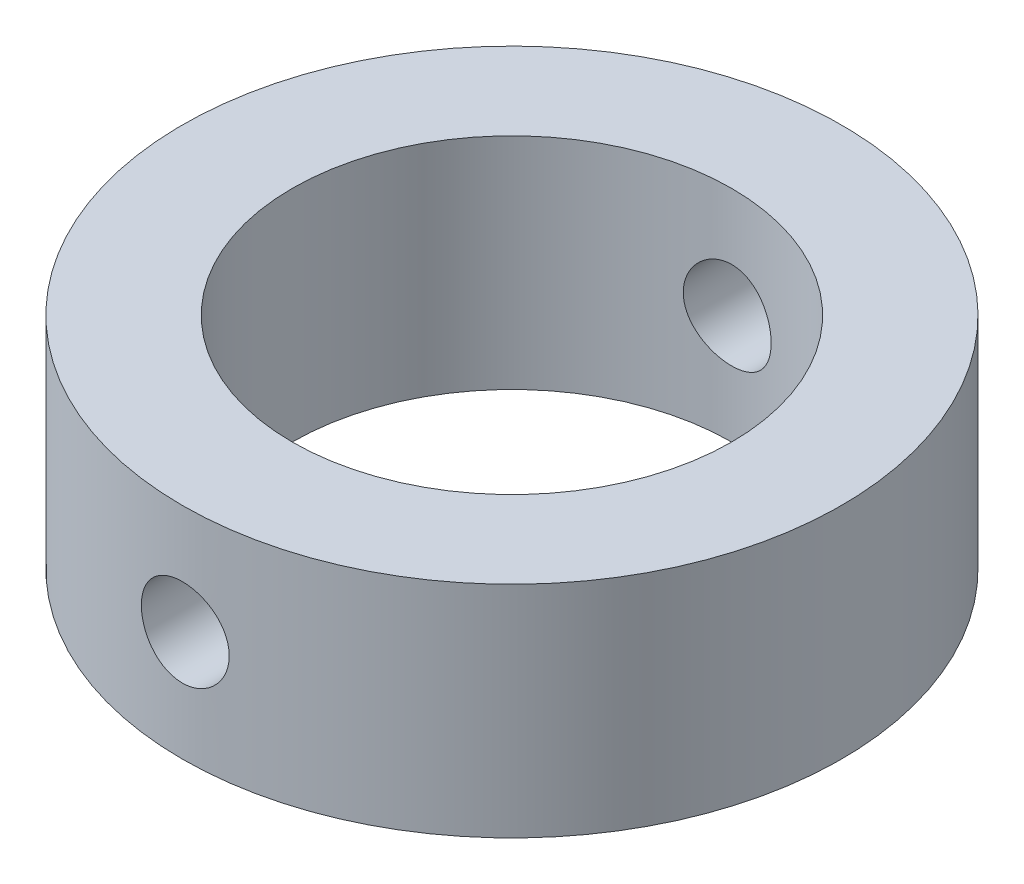
ISO-10303-21;
HEADER;
FILE_DESCRIPTION(('STEP AP214'),'2;1');
FILE_NAME('part.step','',(''),(''),'','','');
FILE_SCHEMA(('AUTOMOTIVE_DESIGN { 1 0 10303 214 1 1 1 1 }'));
ENDSEC;
DATA;
#1=APPLICATION_CONTEXT('core data for automotive mechanical design processes');
#2=APPLICATION_PROTOCOL_DEFINITION('international standard','automotive_design',2000,#1);
#3=PRODUCT_CONTEXT('',#1,'mechanical');
#4=PRODUCT('Part','Part','',(#3));
#5=PRODUCT_RELATED_PRODUCT_CATEGORY('part','',(#4));
#6=PRODUCT_DEFINITION_FORMATION('','',#4);
#7=PRODUCT_DEFINITION_CONTEXT('part definition',#1,'design');
#8=PRODUCT_DEFINITION('design','',#6,#7);
#9=PRODUCT_DEFINITION_SHAPE('','',#8);
#10=(LENGTH_UNIT() NAMED_UNIT(*) SI_UNIT(.MILLI.,.METRE.));
#11=(NAMED_UNIT(*) PLANE_ANGLE_UNIT() SI_UNIT($,.RADIAN.));
#12=(NAMED_UNIT(*) SI_UNIT($,.STERADIAN.) SOLID_ANGLE_UNIT());
#13=UNCERTAINTY_MEASURE_WITH_UNIT(LENGTH_MEASURE(1.E-05),#10,'distance_accuracy_value','');
#14=(GEOMETRIC_REPRESENTATION_CONTEXT(3) GLOBAL_UNCERTAINTY_ASSIGNED_CONTEXT((#13)) GLOBAL_UNIT_ASSIGNED_CONTEXT((#10,
#11,#12)) REPRESENTATION_CONTEXT('',''));
#15=CARTESIAN_POINT('',(0.,0.,0.));
#16=DIRECTION('',(0.,0.,1.));
#17=DIRECTION('',(1.,0.,0.));
#18=AXIS2_PLACEMENT_3D('',#15,#16,#17);
#19=CARTESIAN_POINT('',(0.,15.,0.));
#20=DIRECTION('',(0.,1.,0.));
#21=DIRECTION('',(0.,0.,1.));
#22=AXIS2_PLACEMENT_3D('',#19,#20,#21);
#23=PLANE('',#22);
#24=CARTESIAN_POINT('',(0.,15.,0.));
#25=DIRECTION('',(0.,1.,0.));
#26=DIRECTION('',(0.,0.,1.));
#27=AXIS2_PLACEMENT_3D('',#24,#25,#26);
#28=CIRCLE('',#27,22.5);
#29=CARTESIAN_POINT('',(0.,15.,22.5));
#30=VERTEX_POINT('',#29);
#31=EDGE_CURVE('E10',#30,#30,#28,.T.);
#32=ORIENTED_EDGE('',*,*,#31,.T.);
#33=EDGE_LOOP('',(#32));
#34=FACE_BOUND('',#33,.T.);
#35=CARTESIAN_POINT('',(0.,15.,0.));
#36=DIRECTION('',(0.,1.,0.));
#37=DIRECTION('',(0.,0.,1.));
#38=AXIS2_PLACEMENT_3D('',#35,#36,#37);
#39=CIRCLE('',#38,15.);
#40=CARTESIAN_POINT('',(0.,15.,15.));
#41=VERTEX_POINT('',#40);
#42=EDGE_CURVE('E62',#41,#41,#39,.T.);
#43=ORIENTED_EDGE('',*,*,#42,.F.);
#44=EDGE_LOOP('',(#43));
#45=FACE_BOUND('',#44,.T.);
#46=ADVANCED_FACE('F41',(#34,#45),#23,.T.);
#47=CARTESIAN_POINT('',(0.,0.,0.));
#48=DIRECTION('',(0.,1.,0.));
#49=DIRECTION('',(0.,0.,1.));
#50=AXIS2_PLACEMENT_3D('',#47,#48,#49);
#51=PLANE('',#50);
#52=CARTESIAN_POINT('',(0.,0.,0.));
#53=DIRECTION('',(0.,1.,0.));
#54=DIRECTION('',(0.,0.,1.));
#55=AXIS2_PLACEMENT_3D('',#52,#53,#54);
#56=CIRCLE('',#55,22.5);
#57=CARTESIAN_POINT('',(0.,0.,22.5));
#58=VERTEX_POINT('',#57);
#59=EDGE_CURVE('E56',#58,#58,#56,.T.);
#60=ORIENTED_EDGE('',*,*,#59,.F.);
#61=EDGE_LOOP('',(#60));
#62=FACE_BOUND('',#61,.T.);
#63=CARTESIAN_POINT('',(0.,0.,0.));
#64=DIRECTION('',(0.,1.,0.));
#65=DIRECTION('',(0.,0.,1.));
#66=AXIS2_PLACEMENT_3D('',#63,#64,#65);
#67=CIRCLE('',#66,15.);
#68=CARTESIAN_POINT('',(0.,0.,15.));
#69=VERTEX_POINT('',#68);
#70=EDGE_CURVE('E65',#69,#69,#67,.T.);
#71=ORIENTED_EDGE('',*,*,#70,.T.);
#72=EDGE_LOOP('',(#71));
#73=FACE_BOUND('',#72,.T.);
#74=ADVANCED_FACE('F106',(#62,#73),#51,.F.);
#75=CARTESIAN_POINT('',(0.,15.,0.));
#76=DIRECTION('',(0.,-1.,0.));
#77=DIRECTION('',(0.,0.,-1.));
#78=AXIS2_PLACEMENT_3D('',#75,#76,#77);
#79=CYLINDRICAL_SURFACE('',#78,22.5);
#80=CARTESIAN_POINT('',(0.,10.5,-22.5));
#81=CARTESIAN_POINT('',(-0.167713253503927,10.4999929354396,-22.4999975361382));
#82=CARTESIAN_POINT('',(-0.33552896891442,10.4858886930563,-22.4981050609079));
#83=CARTESIAN_POINT('',(-0.666484087707118,10.4298504764257,-22.4907376669036));
#84=CARTESIAN_POINT('',(-0.829618533499555,10.3878880576543,-22.4852590866258));
#85=CARTESIAN_POINT('',(-1.14637246894048,10.2773974236878,-22.471336197736));
#86=CARTESIAN_POINT('',(-1.29999852458774,10.2088877834423,-22.4628939631646));
#87=CARTESIAN_POINT('',(-1.59354584254545,10.0472896292906,-22.4439807999059));
#88=CARTESIAN_POINT('',(-1.73346930950554,9.95420507825031,-22.4335101983785));
#89=CARTESIAN_POINT('',(-1.99653873375702,9.74548010759372,-22.4116349218495));
#90=CARTESIAN_POINT('',(-2.1195869782438,9.62971703248729,-22.4002253724317));
#91=CARTESIAN_POINT('',(-2.34457103509653,9.37918471638502,-22.3777970633693));
#92=CARTESIAN_POINT('',(-2.44650572995832,9.24441447000629,-22.3667783244351));
#93=CARTESIAN_POINT('',(-2.62673853403361,8.95905131558245,-22.3463315316028));
#94=CARTESIAN_POINT('',(-2.70494411223867,8.80839947628206,-22.3369097664864));
#95=CARTESIAN_POINT('',(-2.83490767510935,8.49595339914482,-22.3207888106885));
#96=CARTESIAN_POINT('',(-2.88666679867917,8.33415964147003,-22.3140895027681));
#97=CARTESIAN_POINT('',(-2.96196910158261,8.00504128424751,-22.30421904853));
#98=CARTESIAN_POINT('',(-2.9856780634276,7.83775524820062,-22.301027180552));
#99=CARTESIAN_POINT('',(-3.00472020822176,7.50155073059107,-22.2984697741397));
#100=CARTESIAN_POINT('',(-3.00005468450402,7.33263232378365,-22.299104061306));
#101=CARTESIAN_POINT('',(-2.96261618908852,6.9991183049581,-22.3041083365948));
#102=CARTESIAN_POINT('',(-2.93002646297642,6.83450170517144,-22.3084539693351));
#103=CARTESIAN_POINT('',(-2.83795086951557,6.51309474485987,-22.3203532916212));
#104=CARTESIAN_POINT('',(-2.77846438892186,6.35630456286748,-22.3279070543119));
#105=CARTESIAN_POINT('',(-2.63408893714787,6.0544355479392,-22.3453989166654));
#106=CARTESIAN_POINT('',(-2.54912096870624,5.90939494320854,-22.3553444118585));
#107=CARTESIAN_POINT('',(-2.35625090016434,5.63556137712351,-22.376493543299));
#108=CARTESIAN_POINT('',(-2.24834760753577,5.50676926116875,-22.3876972449529));
#109=CARTESIAN_POINT('',(-2.01165735039543,5.26802548112715,-22.4102084885038));
#110=CARTESIAN_POINT('',(-1.88271256053967,5.15823023594651,-22.421516153118));
#111=CARTESIAN_POINT('',(-1.60814125520011,4.96181693260741,-22.4428788572739));
#112=CARTESIAN_POINT('',(-1.46251469166355,4.87519894121472,-22.4529338932073));
#113=CARTESIAN_POINT('',(-1.1585883295957,4.72759632345789,-22.4706659061537));
#114=CARTESIAN_POINT('',(-1.00028336826184,4.66662220343053,-22.4783419081343));
#115=CARTESIAN_POINT('',(-0.675556386504373,4.57216602154148,-22.4904423885611));
#116=CARTESIAN_POINT('',(-0.509134799313384,4.53868249404091,-22.4948670403489));
#117=CARTESIAN_POINT('',(-0.174250354988464,4.50036235084332,-22.4999436206528));
#118=CARTESIAN_POINT('',(-0.00581255182056182,4.49531039732477,-22.5006239077357));
#119=CARTESIAN_POINT('',(0.329507425828079,4.51342749619077,-22.4982118730778));
#120=CARTESIAN_POINT('',(0.496389638018499,4.53659586267354,-22.495119643029));
#121=CARTESIAN_POINT('',(0.823220573359409,4.61031698007598,-22.4855276303715));
#122=CARTESIAN_POINT('',(0.98319302476807,4.66076635248323,-22.4790407145438));
#123=CARTESIAN_POINT('',(1.29240764819034,4.78750944890563,-22.4633851388143));
#124=CARTESIAN_POINT('',(1.44164941052346,4.86380415901988,-22.4542163765916));
#125=CARTESIAN_POINT('',(1.72612331792412,5.04058823337497,-22.4341475605511));
#126=CARTESIAN_POINT('',(1.86126872159491,5.14121604857,-22.4232377256857));
#127=CARTESIAN_POINT('',(2.11282942048785,5.36361499383638,-22.4009359306497));
#128=CARTESIAN_POINT('',(2.22924386493568,5.48538708377465,-22.3895439486093));
#129=CARTESIAN_POINT('',(2.44080824134647,5.74756971395933,-22.3674735371027));
#130=CARTESIAN_POINT('',(2.53581491413408,5.88809635010724,-22.3568002316295));
#131=CARTESIAN_POINT('',(2.70087526618221,6.18323911542139,-22.3374619950273));
#132=CARTESIAN_POINT('',(2.7709295026552,6.33785492986557,-22.3287970190518));
#133=CARTESIAN_POINT('',(2.88386754751119,6.65633586304154,-22.3144921767012));
#134=CARTESIAN_POINT('',(2.92683043270193,6.82017252781621,-22.308843513489));
#135=CARTESIAN_POINT('',(2.98462000715938,7.15281544819314,-22.3011862304744));
#136=CARTESIAN_POINT('',(2.99944820140173,7.32162143748665,-22.2991774159701));
#137=CARTESIAN_POINT('',(3.00051728709284,7.65798523628026,-22.2990334694317));
#138=CARTESIAN_POINT('',(2.98698328791739,7.82554236144636,-22.3008678342378));
#139=CARTESIAN_POINT('',(2.93219065030034,8.15597681265581,-22.308137758113));
#140=CARTESIAN_POINT('',(2.89093202224903,8.31885414045297,-22.3135733158325));
#141=CARTESIAN_POINT('',(2.78193465498311,8.63526552487738,-22.3274233540915));
#142=CARTESIAN_POINT('',(2.71420831228562,8.78880391667529,-22.335836439891));
#143=CARTESIAN_POINT('',(2.55422014139606,9.08237382573909,-22.3546956856923));
#144=CARTESIAN_POINT('',(2.46195783945643,9.22240508213407,-22.365141884949));
#145=CARTESIAN_POINT('',(2.25468672764262,9.48613447489262,-22.3869895077459));
#146=CARTESIAN_POINT('',(2.13951040840351,9.6097004216327,-22.3983975863112));
#147=CARTESIAN_POINT('',(1.89003254024735,9.83583482454232,-22.4208257850249));
#148=CARTESIAN_POINT('',(1.75572651109466,9.93839834812538,-22.4318458135347));
#149=CARTESIAN_POINT('',(1.47112948177923,10.1200007076998,-22.4523095270629));
#150=CARTESIAN_POINT('',(1.32077193111594,10.1989359998329,-22.4617461964033));
#151=CARTESIAN_POINT('',(1.00888861438099,10.3303208978176,-22.4779098098846));
#152=CARTESIAN_POINT('',(0.847375018454831,10.3827988629373,-22.4846396538647));
#153=CARTESIAN_POINT('',(0.570882612147626,10.4474220095778,-22.493035826149));
#154=CARTESIAN_POINT('',(0.457636622933667,10.4671098652855,-22.4956344545261));
#155=CARTESIAN_POINT('',(0.229609757424167,10.4934012212482,-22.4991173773616));
#156=CARTESIAN_POINT('',(0.11482889467686,10.5000048369204,-22.500001686942));
#157=CARTESIAN_POINT('',(0.,10.5,-22.5));
#158=B_SPLINE_CURVE_WITH_KNOTS('',3,(#80,#81,#82,#83,#84,#85,#86,#87,#88,#89,#90,#91,#92,#93,
#94,#95,#96,#97,#98,#99,#100,#101,#102,#103,#104,#105,#106,#107,#108,#109,#110,#111,#112,#113,
#114,#115,#116,#117,#118,#119,#120,#121,#122,#123,#124,#125,#126,#127,#128,#129,#130,#131,#132,
#133,#134,#135,#136,#137,#138,#139,#140,#141,#142,#143,#144,#145,#146,#147,#148,#149,#150,#151,
#152,#153,#154,#155,#156,#157),.UNSPECIFIED.,.T.,.F.,(4,2,2,2,2,2,2,2,2,2,2,2,2,2,2,2,2,2,2,2,2,
2,2,2,2,2,2,2,2,2,2,2,2,2,2,2,2,2,4),(0.,0.502720276958615,1.00595464632757,1.50883753924111,
2.01163938846052,2.51723967665338,3.02286671857254,3.53044082267472,4.03799306649307,
4.54253033871538,5.0470446138738,5.54827327647065,6.04951336763776,6.55232374706847,
7.05516027665696,7.56195816727274,8.06875751778444,8.57576430303808,9.08274405587614,
9.58587877488091,10.0890012653172,10.590230450947,11.0914787625532,11.5956491215483,
12.0998423738814,12.6073155680318,13.1147774290957,13.6207511210318,14.1266977467545,
14.6286439124494,15.1305898900312,15.6323010555393,16.1340219089385,16.6395550175266,
17.1452067187674,17.6530429001177,18.1603335748863,18.5045360857096,18.8487355602816),.UNSPECIFIED.);
#159=CARTESIAN_POINT('',(0.,10.5,-22.5));
#160=VERTEX_POINT('',#159);
#161=EDGE_CURVE('E92',#160,#160,#158,.T.);
#162=ORIENTED_EDGE('',*,*,#161,.T.);
#163=EDGE_LOOP('',(#162));
#164=FACE_BOUND('',#163,.T.);
#165=CARTESIAN_POINT('',(3.,7.5,22.2991031209778));
#166=CARTESIAN_POINT('',(2.99999292892183,7.33229421679777,22.2991056676806));
#167=CARTESIAN_POINT('',(2.98588990056203,7.16448595032542,22.3010154696116));
#168=CARTESIAN_POINT('',(2.92985694399183,6.83354630649641,22.3084447289533));
#169=CARTESIAN_POINT('',(2.88789854473666,6.67041989262426,22.3139678794925));
#170=CARTESIAN_POINT('',(2.77741966710399,6.35368294766046,22.3279873821811));
#171=CARTESIAN_POINT('',(2.70891795412568,6.20006578257344,22.3364816334313));
#172=CARTESIAN_POINT('',(2.54733847321029,5.90653338643568,22.3554837337772));
#173=CARTESIAN_POINT('',(2.45426464895203,5.76661596159296,22.3659912596801));
#174=CARTESIAN_POINT('',(2.24555055734277,5.50353981799729,22.3879106598111));
#175=CARTESIAN_POINT('',(2.12978523412289,5.38048070148092,22.399327327406));
#176=CARTESIAN_POINT('',(1.87924384308915,5.15547563181543,22.4217356438735));
#177=CARTESIAN_POINT('',(1.74446679970797,5.05353076278571,22.4327272708986));
#178=CARTESIAN_POINT('',(1.45909758739142,4.87328723742539,22.4530964964055));
#179=CARTESIAN_POINT('',(1.30844765656683,4.79507926606463,22.4624678475342));
#180=CARTESIAN_POINT('',(0.996005724056049,4.6651107537288,22.4784878012371));
#181=CARTESIAN_POINT('',(0.8342141908836,4.61334910143348,22.4851365182189));
#182=CARTESIAN_POINT('',(0.505103062521133,4.5380416356296,22.4949282929341));
#183=CARTESIAN_POINT('',(0.337822085204846,4.51432977748206,22.4980919730761));
#184=CARTESIAN_POINT('',(0.00162750345548431,4.49528008689477,22.5006277195727));
#185=CARTESIAN_POINT('',(-0.167286028083699,4.49994099339522,22.4999999544424));
#186=CARTESIAN_POINT('',(-0.500820186698654,4.53737209581142,22.4950401617536));
#187=CARTESIAN_POINT('',(-0.665461256042677,4.56996369711847,22.4907316700671));
#188=CARTESIAN_POINT('',(-0.986916184068833,4.66205149053226,22.4789208613843));
#189=CARTESIAN_POINT('',(-1.14372987681276,4.72154825275217,22.4714184767105));
#190=CARTESIAN_POINT('',(-1.44562771263619,4.86594516168273,22.4540222850625));
#191=CARTESIAN_POINT('',(-1.59067477402989,4.95092193477462,22.4441212821882));
#192=CARTESIAN_POINT('',(-1.86451753610218,5.14381088592428,22.4230342562856));
#193=CARTESIAN_POINT('',(-1.99331238880023,5.2517242599417,22.4118481662643));
#194=CARTESIAN_POINT('',(-2.23204509231808,5.4884217725384,22.3893388214349));
#195=CARTESIAN_POINT('',(-2.34182855029532,5.61736165229045,22.378015176366));
#196=CARTESIAN_POINT('',(-2.53822039585787,5.89191889705886,22.3565924815386));
#197=CARTESIAN_POINT('',(-2.6248286915453,6.03753632820445,22.3464934366361));
#198=CARTESIAN_POINT('',(-2.7724242912975,6.34146000052005,22.3286636450151));
#199=CARTESIAN_POINT('',(-2.8333981336006,6.49977285677773,22.3209341432218));
#200=CARTESIAN_POINT('',(-2.92785135067386,6.82451703095756,22.3087421319858));
#201=CARTESIAN_POINT('',(-2.96133224031215,6.99094790103985,22.3042794425424));
#202=CARTESIAN_POINT('',(-2.9996424115309,7.32583700250744,22.2991596751552));
#203=CARTESIAN_POINT('',(-3.00468946648218,7.4942698954988,22.2984736726744));
#204=CARTESIAN_POINT('',(-2.98656432283194,7.82957888415711,22.3009083644505));
#205=CARTESIAN_POINT('',(-2.96339281094665,7.99645501760918,22.3040289660712));
#206=CARTESIAN_POINT('',(-2.88967207555529,8.32325397960842,22.3136988065515));
#207=CARTESIAN_POINT('',(-2.8392292548504,8.48320123952715,22.3202347168148));
#208=CARTESIAN_POINT('',(-2.71250767620188,8.79236837017865,22.3359878852161));
#209=CARTESIAN_POINT('',(-2.63622789314075,8.94158781498558,22.3452052497426));
#210=CARTESIAN_POINT('',(-2.45946609625816,9.22604596566122,22.3653516992928));
#211=CARTESIAN_POINT('',(-2.35884184749451,9.36119557255235,22.376290706837));
#212=CARTESIAN_POINT('',(-2.13644748469198,9.61276640765563,22.3986171527477));
#213=CARTESIAN_POINT('',(-2.01467643215631,9.72918680422202,22.410004610999));
#214=CARTESIAN_POINT('',(-1.75249132253736,9.94076483088168,22.43203422983));
#215=CARTESIAN_POINT('',(-1.61196096139879,10.0357789745574,22.4426710507457));
#216=CARTESIAN_POINT('',(-1.31680867847643,10.200852423263,22.4619201221745));
#217=CARTESIAN_POINT('',(-1.16218707377055,10.2709122896342,22.4705324182274));
#218=CARTESIAN_POINT('',(-0.843709158785151,10.3838538923822,22.4847384703673));
#219=CARTESIAN_POINT('',(-0.679882176371044,10.4268171436253,22.4903412723117));
#220=CARTESIAN_POINT('',(-0.347259740134797,10.4846107281915,22.4979347502993));
#221=CARTESIAN_POINT('',(-0.178464543299733,10.4994425140616,22.499925612842));
#222=CARTESIAN_POINT('',(0.157904810567379,10.5005224008605,22.5000697087261));
#223=CARTESIAN_POINT('',(0.325478288882809,10.4869912058916,22.4982525737009));
#224=CARTESIAN_POINT('',(0.655946164578539,10.432198438152,22.4910439982984));
#225=CARTESIAN_POINT('',(0.81884056851161,10.390936904218,22.485652562927));
#226=CARTESIAN_POINT('',(1.13528735188325,10.2819269293851,22.4718983496352));
#227=CARTESIAN_POINT('',(1.28884395231571,10.2141905603882,22.4635369261179));
#228=CARTESIAN_POINT('',(1.58244611794646,10.0541766755311,22.4447662409466));
#229=CARTESIAN_POINT('',(1.72249143359931,9.96189870652016,22.4343569414803));
#230=CARTESIAN_POINT('',(1.98622092909954,9.75460997699573,22.4125543681221));
#231=CARTESIAN_POINT('',(2.10977573574388,9.63943531479568,22.4011543544026));
#232=CARTESIAN_POINT('',(2.33588843381036,9.38996539642449,22.3787079735476));
#233=CARTESIAN_POINT('',(2.43844136296137,9.25566563410142,22.3676616905097));
#234=CARTESIAN_POINT('',(2.62003186467116,8.97107408765783,22.3471216479154));
#235=CARTESIAN_POINT('',(2.69896410641011,8.82071461279206,22.337634925064));
#236=CARTESIAN_POINT('',(2.83034277419568,8.50882729878187,22.3213704974611));
#237=CARTESIAN_POINT('',(2.88281759498929,8.34731164537562,22.3145898900774));
#238=CARTESIAN_POINT('',(2.94743220568238,8.07082758190417,22.3061270075485));
#239=CARTESIAN_POINT('',(2.96711622203802,7.95759259054575,22.3035064293224));
#240=CARTESIAN_POINT('',(2.99340248014674,7.72958773579628,22.2999936221278));
#241=CARTESIAN_POINT('',(3.00000484113448,7.61481788640452,22.2991013774062));
#242=CARTESIAN_POINT('',(3.,7.5,22.2991031209778));
#243=B_SPLINE_CURVE_WITH_KNOTS('',3,(#165,#166,#167,#168,#169,#170,#171,#172,#173,#174,#175,
#176,#177,#178,#179,#180,#181,#182,#183,#184,#185,#186,#187,#188,#189,#190,#191,#192,#193,#194,
#195,#196,#197,#198,#199,#200,#201,#202,#203,#204,#205,#206,#207,#208,#209,#210,#211,#212,#213,
#214,#215,#216,#217,#218,#219,#220,#221,#222,#223,#224,#225,#226,#227,#228,#229,#230,#231,#232,
#233,#234,#235,#236,#237,#238,#239,#240,#241,#242),.UNSPECIFIED.,.T.,.F.,(4,2,2,2,2,2,2,2,2,2,2,
2,2,2,2,2,2,2,2,2,2,2,2,2,2,2,2,2,2,2,2,2,2,2,2,2,2,2,4),(0.,0.502697833875675,1.00591026915852,
1.50876759415237,2.01154426252435,2.51717392681748,3.02282954643357,3.5303933478772,
4.03793581885392,4.54245854287453,5.04695884297285,5.54825713004929,6.04956604000018,
6.55239792684377,7.05525603876943,7.56202372603438,8.06879342278637,8.57582891483612,
9.08283646723653,9.58595553872895,10.0890623667531,10.5902202722789,11.0913980642731,
11.595577922135,12.0997801612593,12.6072676764676,13.1147437751273,13.620685856555,
14.1266018133322,14.6285956478445,15.1305887793096,15.6323532802529,16.1341270467162,
16.6396311355341,17.145254526141,17.6531001297407,18.1603995347189,18.5045691141841,
18.8487355566505),.UNSPECIFIED.);
#244=CARTESIAN_POINT('',(3.,7.5,22.2991031209778));
#245=VERTEX_POINT('',#244);
#246=EDGE_CURVE('E86',#245,#245,#243,.T.);
#247=ORIENTED_EDGE('',*,*,#246,.T.);
#248=EDGE_LOOP('',(#247));
#249=FACE_BOUND('',#248,.T.);
#250=ORIENTED_EDGE('',*,*,#31,.F.);
#251=EDGE_LOOP('',(#250));
#252=FACE_BOUND('',#251,.T.);
#253=ORIENTED_EDGE('',*,*,#59,.T.);
#254=EDGE_LOOP('',(#253));
#255=FACE_BOUND('',#254,.T.);
#256=ADVANCED_FACE('F43',(#164,#249,#252,#255),#79,.T.);
#257=CARTESIAN_POINT('',(0.,15.,0.));
#258=DIRECTION('',(0.,-1.,0.));
#259=DIRECTION('',(0.,0.,-1.));
#260=AXIS2_PLACEMENT_3D('',#257,#258,#259);
#261=CYLINDRICAL_SURFACE('',#260,15.);
#262=CARTESIAN_POINT('',(0.,10.5,-15.));
#263=CARTESIAN_POINT('',(-0.1667307203779,10.499993866505,-14.9999969274261));
#264=CARTESIAN_POINT('',(-0.333538980604567,10.4860534710971,-14.9971915553469));
#265=CARTESIAN_POINT('',(-0.662440523067058,10.4307044996543,-14.9862709686969));
#266=CARTESIAN_POINT('',(-0.824529952624068,10.3892741015955,-14.9781515358056));
#267=CARTESIAN_POINT('',(-1.13919091578994,10.2802761791376,-14.9575094783486));
#268=CARTESIAN_POINT('',(-1.2917714037994,10.2127336894659,-14.9449910723015));
#269=CARTESIAN_POINT('',(-1.58342396659268,10.0535032574661,-14.9169119410594));
#270=CARTESIAN_POINT('',(-1.72249684522744,9.96181675317838,-14.9013513970712));
#271=CARTESIAN_POINT('',(-1.9850804319446,9.7555845171257,-14.8686649598991));
#272=CARTESIAN_POINT('',(-2.10838185347557,9.64077493382639,-14.8515223651304));
#273=CARTESIAN_POINT('',(-2.33411026982409,9.39212275082489,-14.8177254135776));
#274=CARTESIAN_POINT('',(-2.43653563431127,9.25827866599464,-14.8010710950127));
#275=CARTESIAN_POINT('',(-2.61849526004286,8.97385142096437,-14.7699732543785));
#276=CARTESIAN_POINT('',(-2.6978128165976,8.82312706861092,-14.7555512209484));
#277=CARTESIAN_POINT('',(-2.82991699974092,8.51015454298776,-14.7307880417525));
#278=CARTESIAN_POINT('',(-2.88270624731171,8.34790750996097,-14.7204464928588));
#279=CARTESIAN_POINT('',(-2.95957589965448,8.01874690827625,-14.7051841575661));
#280=CARTESIAN_POINT('',(-2.98402349387633,7.85192236757332,-14.7001941032156));
#281=CARTESIAN_POINT('',(-3.00465638317836,7.51647053590697,-14.6959912518188));
#282=CARTESIAN_POINT('',(-3.0008445681405,7.34784343103956,-14.6967778640352));
#283=CARTESIAN_POINT('',(-2.96536371930546,7.01625963593699,-14.7039765344455));
#284=CARTESIAN_POINT('',(-2.93411562073172,6.85325578311806,-14.7103035857629));
#285=CARTESIAN_POINT('',(-2.84531365386915,6.53485177001099,-14.7277363848));
#286=CARTESIAN_POINT('',(-2.78775852930204,6.37945197324298,-14.7388423607334));
#287=CARTESIAN_POINT('',(-2.64757435102416,6.0794542148892,-14.7646685550122));
#288=CARTESIAN_POINT('',(-2.56477845369634,5.93493636129248,-14.7794126944111));
#289=CARTESIAN_POINT('',(-2.37658072371804,5.66168745008156,-14.8108385631919));
#290=CARTESIAN_POINT('',(-2.27117629307049,5.53295820944653,-14.827520515151));
#291=CARTESIAN_POINT('',(-2.03849980368175,5.29251179262919,-14.8613106372439));
#292=CARTESIAN_POINT('',(-1.91086848363733,5.18114229642261,-14.8784210763271));
#293=CARTESIAN_POINT('',(-1.63855507218603,4.98133846109633,-14.9108654614323));
#294=CARTESIAN_POINT('',(-1.49387276213817,4.89290441611926,-14.9261993846692));
#295=CARTESIAN_POINT('',(-1.19117816063676,4.74141747232207,-14.9534007048266));
#296=CARTESIAN_POINT('',(-1.0331454587559,4.67840431906639,-14.9652626654482));
#297=CARTESIAN_POINT('',(-0.708446929345993,4.5799185778843,-14.9841422696357));
#298=CARTESIAN_POINT('',(-0.541782150217349,4.54444265377912,-14.9911605000159));
#299=CARTESIAN_POINT('',(-0.207538216881451,4.50253063861717,-14.999480156006));
#300=CARTESIAN_POINT('',(-0.0400209849767287,4.49561874137919,-15.0008752395741));
#301=CARTESIAN_POINT('',(0.293774802578142,4.50974957682654,-14.9980515579031));
#302=CARTESIAN_POINT('',(0.46005342733138,4.53079073805779,-14.9938331082434));
#303=CARTESIAN_POINT('',(0.785116979839623,4.59983512063187,-14.9803149602405));
#304=CARTESIAN_POINT('',(0.943955845019709,4.64759420549371,-14.9710612921262));
#305=CARTESIAN_POINT('',(1.251370882499,4.76845194796743,-14.948506561831));
#306=CARTESIAN_POINT('',(1.39994628491262,4.84155250403049,-14.9352051964268));
#307=CARTESIAN_POINT('',(1.68462352105865,5.01204747195394,-14.9057973459988));
#308=CARTESIAN_POINT('',(1.82055038025656,5.10972834311683,-14.8896585131116));
#309=CARTESIAN_POINT('',(2.07425405735762,5.32622757362184,-14.8564420448965));
#310=CARTESIAN_POINT('',(2.19202892679229,5.4450481991996,-14.8393643090516));
#311=CARTESIAN_POINT('',(2.40792177232253,5.70262005567337,-14.8058791067089));
#312=CARTESIAN_POINT('',(2.50571310734597,5.84164723266401,-14.7894858069991));
#313=CARTESIAN_POINT('',(2.67655626015362,6.13443408407004,-14.7595257538858));
#314=CARTESIAN_POINT('',(2.74960906776871,6.28819316872066,-14.7459588874003));
#315=CARTESIAN_POINT('',(2.86845552474588,6.60530473844865,-14.7233022175315));
#316=CARTESIAN_POINT('',(2.91439049937315,6.76860252363096,-14.7141892461656));
#317=CARTESIAN_POINT('',(2.97812595488159,7.10080036047272,-14.7014231037608));
#318=CARTESIAN_POINT('',(2.99593010467534,7.26969967862804,-14.6977692207333));
#319=CARTESIAN_POINT('',(3.00276273260241,7.60502659363295,-14.6963744889414));
#320=CARTESIAN_POINT('',(2.99230736421269,7.77144344678103,-14.698527575679));
#321=CARTESIAN_POINT('',(2.94405691230018,8.10009494971508,-14.7082672045384));
#322=CARTESIAN_POINT('',(2.90626204838789,8.26232963308441,-14.7158537030151));
#323=CARTESIAN_POINT('',(2.80463570549686,8.57768313372163,-14.7355579265748));
#324=CARTESIAN_POINT('',(2.74086752015203,8.73082308150725,-14.7476646305649));
#325=CARTESIAN_POINT('',(2.58916393380481,9.02431116220332,-14.7750514492251));
#326=CARTESIAN_POINT('',(2.50122650632465,9.16465822117541,-14.7903318299668));
#327=CARTESIAN_POINT('',(2.30191774435924,9.43114671645094,-14.8226688156968));
#328=CARTESIAN_POINT('',(2.19017366170554,9.55700629580279,-14.839751187291));
#329=CARTESIAN_POINT('',(1.94719310703942,9.78835861658751,-14.8735824561586));
#330=CARTESIAN_POINT('',(1.81595216146,9.89384667095182,-14.8903312758955));
#331=CARTESIAN_POINT('',(1.53605288726474,10.0825039318393,-14.9218149716391));
#332=CARTESIAN_POINT('',(1.3872266532895,10.1654280098401,-14.9365269365774));
#333=CARTESIAN_POINT('',(1.0774990828222,10.3049583677898,-14.96205375255));
#334=CARTESIAN_POINT('',(0.916608782589378,10.3615883685975,-14.9728721141585));
#335=CARTESIAN_POINT('',(0.629464466771338,10.4359558441341,-14.9872911778611));
#336=CARTESIAN_POINT('',(0.504844992041354,10.4599295811233,-14.9920290947535));
#337=CARTESIAN_POINT('',(0.253498575630201,10.4919537370751,-14.9983846241968));
#338=CARTESIAN_POINT('',(0.126771701245857,10.5000046635293,-15.0000023361946));
#339=CARTESIAN_POINT('',(0.,10.5,-15.));
#340=B_SPLINE_CURVE_WITH_KNOTS('',3,(#262,#263,#264,#265,#266,#267,#268,#269,#270,#271,#272,
#273,#274,#275,#276,#277,#278,#279,#280,#281,#282,#283,#284,#285,#286,#287,#288,#289,#290,#291,
#292,#293,#294,#295,#296,#297,#298,#299,#300,#301,#302,#303,#304,#305,#306,#307,#308,#309,#310,
#311,#312,#313,#314,#315,#316,#317,#318,#319,#320,#321,#322,#323,#324,#325,#326,#327,#328,#329,
#330,#331,#332,#333,#334,#335,#336,#337,#338,#339),.UNSPECIFIED.,.T.,.F.,(4,2,2,2,2,2,2,2,2,2,2,
2,2,2,2,2,2,2,2,2,2,2,2,2,2,2,2,2,2,2,2,2,2,2,2,2,2,2,4),(0.,0.499728391983776,0.99985395207397,
1.49950120575103,1.99911870669259,2.50479801033656,3.0105167902421,3.52083585017768,
4.03110448095592,4.53468555310762,5.03821512843675,5.53415181018835,6.03011217761189,
6.52942470610778,7.02879464249011,7.53714757474052,8.04550702619461,8.55465824562072,
9.06374777094108,9.56432207028795,10.064868229736,10.5609136185217,11.0569961764807,
11.5591519810008,12.0613616503779,12.5712188573768,13.081055661704,13.5882114309817,
14.0953010499124,14.593191677031,15.0910783047783,15.5877588375933,16.084481027456,
16.5896422871743,17.0949196359879,17.6054849002691,18.1155886655256,18.4955632586968,
18.8755257411299),.UNSPECIFIED.);
#341=CARTESIAN_POINT('',(0.,10.5,-15.));
#342=VERTEX_POINT('',#341);
#343=EDGE_CURVE('E46',#342,#342,#340,.T.);
#344=ORIENTED_EDGE('',*,*,#343,.F.);
#345=EDGE_LOOP('',(#344));
#346=FACE_BOUND('',#345,.T.);
#347=CARTESIAN_POINT('',(3.,7.5,14.6969384566991));
#348=CARTESIAN_POINT('',(2.99999383762581,7.33330687352653,14.6969417707994));
#349=CARTESIAN_POINT('',(2.98605951515443,7.16653612999998,14.6998052480611));
#350=CARTESIAN_POINT('',(2.93073685074852,6.8377124845706,14.7109329391462));
#351=CARTESIAN_POINT('',(2.88932654121148,6.67566346609206,14.7192014743436));
#352=CARTESIAN_POINT('',(2.78038734785924,6.36108808993737,14.7401662116556));
#353=CARTESIAN_POINT('',(2.71288444245786,6.20855243540223,14.7528580086323));
#354=CARTESIAN_POINT('',(2.55374732301151,5.91697546590913,14.7812339844198));
#355=CARTESIAN_POINT('',(2.46211445580345,5.77793339838629,14.7969179962038));
#356=CARTESIAN_POINT('',(2.25593722696031,5.51531698843842,14.8297589908276));
#357=CARTESIAN_POINT('',(2.14111696773996,5.39196123634808,14.8469321351174));
#358=CARTESIAN_POINT('',(1.89242036706393,5.16612739926306,14.880674169078));
#359=CARTESIAN_POINT('',(1.75854269093395,5.06365077774842,14.8972430163249));
#360=CARTESIAN_POINT('',(1.47408406777277,4.88163594711462,14.9280838925269));
#361=CARTESIAN_POINT('',(1.32336770301663,4.80230545855008,14.9423346432465));
#362=CARTESIAN_POINT('',(1.01041245116182,4.67017518885559,14.9667521065089));
#363=CARTESIAN_POINT('',(0.84817464426166,4.61737292429703,14.9769192013236));
#364=CARTESIAN_POINT('',(0.519050319835484,4.54047841914113,14.9919096206526));
#365=CARTESIAN_POINT('',(0.352253217644444,4.51601706728698,14.9968015886438));
#366=CARTESIAN_POINT('',(0.0168557053126103,4.49534714448505,15.0009276355081));
#367=CARTESIAN_POINT('',(-0.151744529495528,4.49913585106253,15.0001622595828));
#368=CARTESIAN_POINT('',(-0.483426002230765,4.53457854064666,14.9931130460555));
#369=CARTESIAN_POINT('',(-0.646551642895409,4.56583493150354,14.9869079509751));
#370=CARTESIAN_POINT('',(-0.965194879740902,4.65469509737668,14.9697653147823));
#371=CARTESIAN_POINT('',(-1.12071217124139,4.71229992657562,14.9588275843212));
#372=CARTESIAN_POINT('',(-1.42085838960266,4.8525901204418,14.9333188805988));
#373=CARTESIAN_POINT('',(-1.5654125224017,4.93543125331466,14.9187254452567));
#374=CARTESIAN_POINT('',(-1.83871513757927,5.1237272317098,14.8875140842136));
#375=CARTESIAN_POINT('',(-1.967461798575,5.22918467931155,14.8708959256567));
#376=CARTESIAN_POINT('',(-2.20785429316037,5.46190086632542,14.8371289309338));
#377=CARTESIAN_POINT('',(-2.31916294972089,5.58950756018877,14.8199758937255));
#378=CARTESIAN_POINT('',(-2.51885547953042,5.86174932735226,14.7873471479628));
#379=CARTESIAN_POINT('',(-2.60723891918325,6.00638472264959,14.7718714711364));
#380=CARTESIAN_POINT('',(-2.75868844440564,6.30906249546541,14.7443414241877));
#381=CARTESIAN_POINT('',(-2.82169994333313,6.46713290291899,14.7322944469065));
#382=CARTESIAN_POINT('',(-2.92017102488275,6.79191397117197,14.7130942896382));
#383=CARTESIAN_POINT('',(-2.95563419836993,6.95862350285725,14.7059404718528));
#384=CARTESIAN_POINT('',(-2.99749801810815,7.29289457399713,14.6974643780348));
#385=CARTESIAN_POINT('',(-3.00438557669374,7.46039272293102,14.6960444117146));
#386=CARTESIAN_POINT('',(-2.99021288493222,7.79414466959905,14.6989345706656));
#387=CARTESIAN_POINT('',(-2.96915421936733,7.96039853735659,14.7032443710116));
#388=CARTESIAN_POINT('',(-2.90010662422247,8.28530592087671,14.7170169748474));
#389=CARTESIAN_POINT('',(-2.8523778625179,8.44401702910729,14.7264299704349));
#390=CARTESIAN_POINT('',(-2.73162310592555,8.75118983708622,14.7493046805499));
#391=CARTESIAN_POINT('',(-2.65859502711953,8.89965069130716,14.7627667285881));
#392=CARTESIAN_POINT('',(-2.48821242664679,9.18423932985048,14.7924421788612));
#393=CARTESIAN_POINT('',(-2.39055323394826,9.32018113890248,14.8086891559471));
#394=CARTESIAN_POINT('',(-2.17408671663814,9.57392493600275,14.8420117147991));
#395=CARTESIAN_POINT('',(-2.05527721543361,9.69172505474776,14.8590873817145));
#396=CARTESIAN_POINT('',(-1.79769682049367,9.90768767755673,14.8924603760765));
#397=CARTESIAN_POINT('',(-1.65864749678889,10.00552096395,14.9087417312605));
#398=CARTESIAN_POINT('',(-1.36580368990427,10.1764376444988,14.9384138288586));
#399=CARTESIAN_POINT('',(-1.21200982630052,10.2495220780343,14.9518046926563));
#400=CARTESIAN_POINT('',(-0.894908042472039,10.3683866152399,14.974118821832));
#401=CARTESIAN_POINT('',(-0.731660020434236,10.4143215546788,14.9830673742781));
#402=CARTESIAN_POINT('',(-0.399568364039737,10.4780737429915,14.9955970781298));
#403=CARTESIAN_POINT('',(-0.230725406133636,10.495894378427,14.9991788759955));
#404=CARTESIAN_POINT('',(0.104618681710862,10.5027809428887,15.0005562136234));
#405=CARTESIAN_POINT('',(0.27110943642448,10.4923418413687,14.9984513564799));
#406=CARTESIAN_POINT('',(0.599913093946948,10.4440981483565,14.9889013068102));
#407=CARTESIAN_POINT('',(0.762226049261166,10.4062939009556,14.9814561814329));
#408=CARTESIAN_POINT('',(1.07775824923519,10.3046130237252,14.9620649509476));
#409=CARTESIAN_POINT('',(1.23099732972049,10.2407958656071,14.9501291174284));
#410=CARTESIAN_POINT('',(1.52466366055821,10.0889632760067,14.9230416637104));
#411=CARTESIAN_POINT('',(1.66508989730354,10.0009459322865,14.9078897894096));
#412=CARTESIAN_POINT('',(1.93159167031775,9.80154183881615,14.8757279747022));
#413=CARTESIAN_POINT('',(2.05739914834453,9.68980099084868,14.858692002537));
#414=CARTESIAN_POINT('',(2.28864785327552,9.44684927970369,14.8248366872359));
#415=CARTESIAN_POINT('',(2.39408424962674,9.31563381156023,14.8080173963616));
#416=CARTESIAN_POINT('',(2.58267665834994,9.03576204992871,14.7763002820179));
#417=CARTESIAN_POINT('',(2.66558044385427,8.88693311663624,14.7614251071368));
#418=CARTESIAN_POINT('',(2.80507214779868,8.5772016802197,14.7355571137924));
#419=CARTESIAN_POINT('',(2.86168393792249,8.41631028393843,14.7245607757495));
#420=CARTESIAN_POINT('',(2.93600741957297,8.12921263367138,14.7098904341354));
#421=CARTESIAN_POINT('',(2.95996169557105,8.00464374145813,14.7050635474382));
#422=CARTESIAN_POINT('',(2.99196005387913,7.75339813634659,14.6985863537725));
#423=CARTESIAN_POINT('',(3.00000468468793,7.62672149626659,14.6969359372925));
#424=CARTESIAN_POINT('',(3.,7.5,14.6969384566991));
#425=B_SPLINE_CURVE_WITH_KNOTS('',3,(#347,#348,#349,#350,#351,#352,#353,#354,#355,#356,#357,
#358,#359,#360,#361,#362,#363,#364,#365,#366,#367,#368,#369,#370,#371,#372,#373,#374,#375,#376,
#377,#378,#379,#380,#381,#382,#383,#384,#385,#386,#387,#388,#389,#390,#391,#392,#393,#394,#395,
#396,#397,#398,#399,#400,#401,#402,#403,#404,#405,#406,#407,#408,#409,#410,#411,#412,#413,#414,
#415,#416,#417,#418,#419,#420,#421,#422,#423,#424),.UNSPECIFIED.,.T.,.F.,(4,2,2,2,2,2,2,2,2,2,2,
2,2,2,2,2,2,2,2,2,2,2,2,2,2,2,2,2,2,2,2,2,2,2,2,2,2,2,4),(0.,0.499615391608283,
0.999630717852889,1.49914949382176,1.99864039457959,2.5044675764531,3.01033020106266,
3.5206020131235,4.03082604739679,4.53432746649241,5.03778036348745,5.53406368900612,
6.03036687221251,6.52979772666909,7.02928607310198,7.5374804028745,8.04568434368161,
8.5549758951833,9.06420105048074,9.5647127341378,10.0651960358526,10.5608802534996,
11.0566053106319,11.5587917932356,12.0610299861063,12.5709780520035,13.0809046989031,
13.5878944073595,14.0948230407488,14.5929305224406,15.0910317410027,15.5880005122636,
16.0850085640405,16.5900345607679,17.0951801666934,17.6057669573882,18.1158892527059,
18.4957141091448,18.8755258705644),.UNSPECIFIED.);
#426=CARTESIAN_POINT('',(3.,7.5,14.6969384566991));
#427=VERTEX_POINT('',#426);
#428=EDGE_CURVE('E67',#427,#427,#425,.T.);
#429=ORIENTED_EDGE('',*,*,#428,.F.);
#430=EDGE_LOOP('',(#429));
#431=FACE_BOUND('',#430,.T.);
#432=ORIENTED_EDGE('',*,*,#42,.T.);
#433=EDGE_LOOP('',(#432));
#434=FACE_BOUND('',#433,.T.);
#435=ORIENTED_EDGE('',*,*,#70,.F.);
#436=EDGE_LOOP('',(#435));
#437=FACE_BOUND('',#436,.T.);
#438=ADVANCED_FACE('F73',(#346,#431,#434,#437),#261,.F.);
#439=CARTESIAN_POINT('',(0.,7.5,-36.));
#440=DIRECTION('',(0.,0.,1.));
#441=DIRECTION('',(1.,0.,0.));
#442=AXIS2_PLACEMENT_3D('',#439,#440,#441);
#443=CYLINDRICAL_SURFACE('',#442,3.);
#444=ORIENTED_EDGE('',*,*,#428,.T.);
#445=EDGE_LOOP('',(#444));
#446=FACE_BOUND('',#445,.T.);
#447=ORIENTED_EDGE('',*,*,#246,.F.);
#448=EDGE_LOOP('',(#447));
#449=FACE_BOUND('',#448,.T.);
#450=ADVANCED_FACE('F79',(#446,#449),#443,.F.);
#451=ORIENTED_EDGE('',*,*,#343,.T.);
#452=EDGE_LOOP('',(#451));
#453=FACE_BOUND('',#452,.T.);
#454=ORIENTED_EDGE('',*,*,#161,.F.);
#455=EDGE_LOOP('',(#454));
#456=FACE_BOUND('',#455,.T.);
#457=ADVANCED_FACE('F76',(#453,#456),#443,.F.);
#458=CLOSED_SHELL('',(#46,#74,#256,#438,#450,#457));
#459=MANIFOLD_SOLID_BREP('B2',#458);
#460=ADVANCED_BREP_SHAPE_REPRESENTATION('',(#18,#459),#14);
#461=SHAPE_DEFINITION_REPRESENTATION(#9,#460);
ENDSEC;
END-ISO-10303-21;
